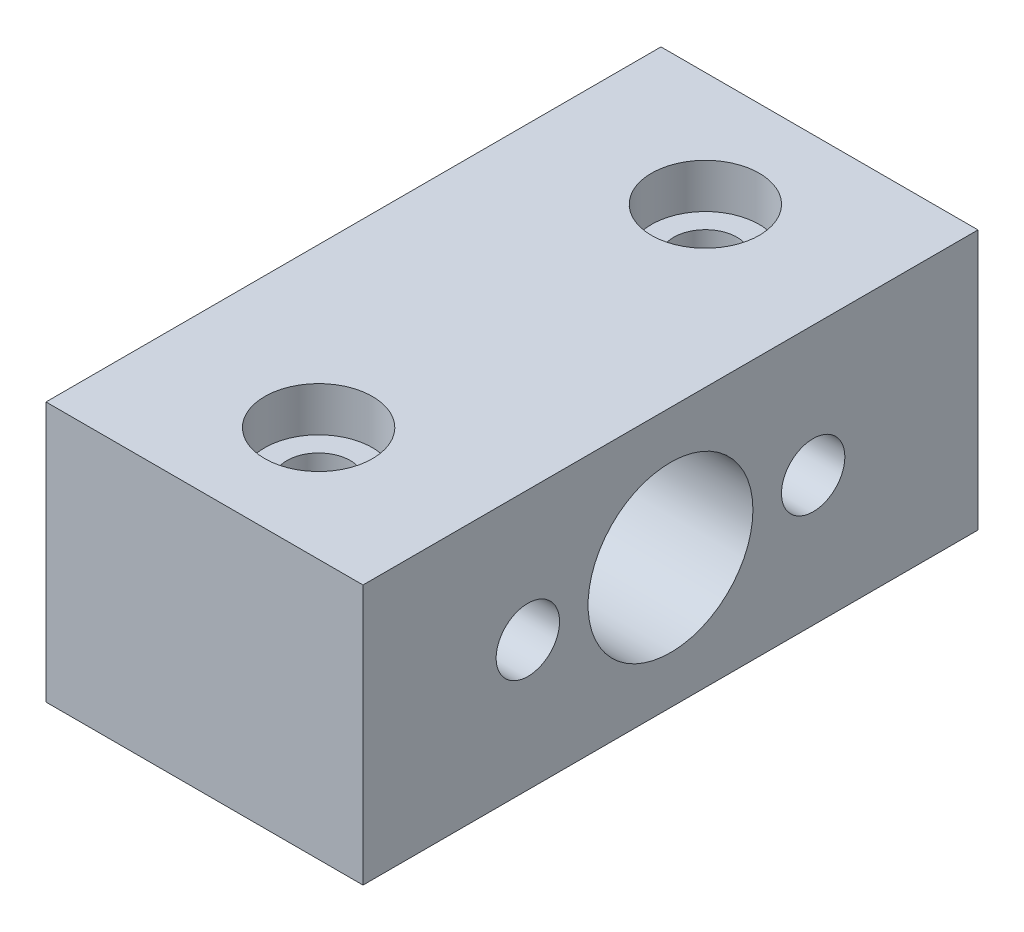
ISO-10303-21;
HEADER;
FILE_DESCRIPTION(('STEP AP214'),'2;1');
FILE_NAME('part.step','',(''),(''),'','','');
FILE_SCHEMA(('AUTOMOTIVE_DESIGN { 1 0 10303 214 1 1 1 1 }'));
ENDSEC;
DATA;
#1=APPLICATION_CONTEXT('core data for automotive mechanical design processes');
#2=APPLICATION_PROTOCOL_DEFINITION('international standard','automotive_design',2000,#1);
#3=PRODUCT_CONTEXT('',#1,'mechanical');
#4=PRODUCT('Part','Part','',(#3));
#5=PRODUCT_RELATED_PRODUCT_CATEGORY('part','',(#4));
#6=PRODUCT_DEFINITION_FORMATION('','',#4);
#7=PRODUCT_DEFINITION_CONTEXT('part definition',#1,'design');
#8=PRODUCT_DEFINITION('design','',#6,#7);
#9=PRODUCT_DEFINITION_SHAPE('','',#8);
#10=(LENGTH_UNIT() NAMED_UNIT(*) SI_UNIT(.MILLI.,.METRE.));
#11=(NAMED_UNIT(*) PLANE_ANGLE_UNIT() SI_UNIT($,.RADIAN.));
#12=(NAMED_UNIT(*) SI_UNIT($,.STERADIAN.) SOLID_ANGLE_UNIT());
#13=UNCERTAINTY_MEASURE_WITH_UNIT(LENGTH_MEASURE(1.E-05),#10,'distance_accuracy_value','');
#14=(GEOMETRIC_REPRESENTATION_CONTEXT(3) GLOBAL_UNCERTAINTY_ASSIGNED_CONTEXT((#13)) GLOBAL_UNIT_ASSIGNED_CONTEXT((#10,
#11,#12)) REPRESENTATION_CONTEXT('',''));
#15=CARTESIAN_POINT('',(0.,0.,0.));
#16=DIRECTION('',(0.,0.,1.));
#17=DIRECTION('',(1.,0.,0.));
#18=AXIS2_PLACEMENT_3D('',#15,#16,#17);
#19=CARTESIAN_POINT('',(-0.944881889763782,19.1712598425197,48.5));
#20=DIRECTION('',(1.,0.,0.));
#21=DIRECTION('',(0.,1.,0.));
#22=AXIS2_PLACEMENT_3D('',#19,#20,#21);
#23=PLANE('',#22);
#24=CARTESIAN_POINT('',(-0.944881889763782,8.92125984251969,24.25));
#25=DIRECTION('',(1.,0.,0.));
#26=DIRECTION('',(0.,1.,0.));
#27=AXIS2_PLACEMENT_3D('',#24,#25,#26);
#28=CIRCLE('',#27,6.5);
#29=CARTESIAN_POINT('',(-0.944881889763783,15.4212598425197,24.25));
#30=VERTEX_POINT('',#29);
#31=EDGE_CURVE('E132',#30,#30,#28,.F.);
#32=ORIENTED_EDGE('',*,*,#31,.F.);
#33=EDGE_LOOP('',(#32));
#34=FACE_BOUND('',#33,.T.);
#35=DIRECTION('',(0.,-1.,0.));
#36=VECTOR('',#35,1.);
#37=CARTESIAN_POINT('',(-0.944881889763782,19.1712598425197,0.));
#38=LINE('',#37,#36);
#39=CARTESIAN_POINT('',(-0.944881889763782,19.1712598425197,0.));
#40=VERTEX_POINT('',#39);
#41=CARTESIAN_POINT('',(-0.944881889763779,-1.32874015748032,0.));
#42=VERTEX_POINT('',#41);
#43=EDGE_CURVE('E95',#40,#42,#38,.T.);
#44=ORIENTED_EDGE('',*,*,#43,.T.);
#45=DIRECTION('',(0.,0.,-1.));
#46=VECTOR('',#45,1.);
#47=CARTESIAN_POINT('',(-0.944881889763779,-1.32874015748032,48.5));
#48=LINE('',#47,#46);
#49=CARTESIAN_POINT('',(-0.944881889763779,-1.32874015748032,48.5));
#50=VERTEX_POINT('',#49);
#51=EDGE_CURVE('E11',#50,#42,#48,.T.);
#52=ORIENTED_EDGE('',*,*,#51,.F.);
#53=DIRECTION('',(0.,-1.,0.));
#54=VECTOR('',#53,1.);
#55=CARTESIAN_POINT('',(-0.944881889763782,19.1712598425197,48.5));
#56=LINE('',#55,#54);
#57=CARTESIAN_POINT('',(-0.944881889763782,19.1712598425197,48.5));
#58=VERTEX_POINT('',#57);
#59=EDGE_CURVE('E83',#58,#50,#56,.T.);
#60=ORIENTED_EDGE('',*,*,#59,.F.);
#61=DIRECTION('',(0.,0.,-1.));
#62=VECTOR('',#61,1.);
#63=CARTESIAN_POINT('',(-0.944881889763782,19.1712598425197,48.5));
#64=LINE('',#63,#62);
#65=EDGE_CURVE('E91',#58,#40,#64,.T.);
#66=ORIENTED_EDGE('',*,*,#65,.T.);
#67=EDGE_LOOP('',(#44,#52,#60,#66));
#68=FACE_BOUND('',#67,.T.);
#69=ADVANCED_FACE('F32',(#34,#68),#23,.F.);
#70=CARTESIAN_POINT('',(-0.944881889763779,-1.32874015748032,48.5));
#71=DIRECTION('',(0.,1.,0.));
#72=DIRECTION('',(0.,0.,1.));
#73=AXIS2_PLACEMENT_3D('',#70,#71,#72);
#74=PLANE('',#73);
#75=CARTESIAN_POINT('',(11.5551181102362,-1.32874015748032,9.));
#76=DIRECTION('',(0.,1.,0.));
#77=DIRECTION('',(0.,0.,1.));
#78=AXIS2_PLACEMENT_3D('',#75,#76,#77);
#79=CIRCLE('',#78,2.5);
#80=CARTESIAN_POINT('',(11.5551181102362,-1.32874015748032,11.5));
#81=VERTEX_POINT('',#80);
#82=EDGE_CURVE('E126',#81,#81,#79,.F.);
#83=ORIENTED_EDGE('',*,*,#82,.F.);
#84=EDGE_LOOP('',(#83));
#85=FACE_BOUND('',#84,.T.);
#86=CARTESIAN_POINT('',(11.5551181102362,-1.32874015748032,39.5));
#87=DIRECTION('',(0.,1.,0.));
#88=DIRECTION('',(0.,0.,1.));
#89=AXIS2_PLACEMENT_3D('',#86,#87,#88);
#90=CIRCLE('',#89,2.5);
#91=CARTESIAN_POINT('',(11.5551181102362,-1.32874015748032,42.));
#92=VERTEX_POINT('',#91);
#93=EDGE_CURVE('E118',#92,#92,#90,.F.);
#94=ORIENTED_EDGE('',*,*,#93,.F.);
#95=EDGE_LOOP('',(#94));
#96=FACE_BOUND('',#95,.T.);
#97=DIRECTION('',(1.,0.,0.));
#98=VECTOR('',#97,1.);
#99=CARTESIAN_POINT('',(-0.944881889763779,-1.32874015748032,0.));
#100=LINE('',#99,#98);
#101=CARTESIAN_POINT('',(24.0551181102362,-1.32874015748032,0.));
#102=VERTEX_POINT('',#101);
#103=EDGE_CURVE('E87',#42,#102,#100,.T.);
#104=ORIENTED_EDGE('',*,*,#103,.T.);
#105=DIRECTION('',(0.,0.,-1.));
#106=VECTOR('',#105,1.);
#107=CARTESIAN_POINT('',(24.0551181102362,-1.32874015748032,48.5));
#108=LINE('',#107,#106);
#109=CARTESIAN_POINT('',(24.0551181102362,-1.32874015748032,48.5));
#110=VERTEX_POINT('',#109);
#111=EDGE_CURVE('E40',#110,#102,#108,.T.);
#112=ORIENTED_EDGE('',*,*,#111,.F.);
#113=DIRECTION('',(1.,0.,0.));
#114=VECTOR('',#113,1.);
#115=CARTESIAN_POINT('',(-0.944881889763779,-1.32874015748032,48.5));
#116=LINE('',#115,#114);
#117=EDGE_CURVE('E78',#50,#110,#116,.T.);
#118=ORIENTED_EDGE('',*,*,#117,.F.);
#119=ORIENTED_EDGE('',*,*,#51,.T.);
#120=EDGE_LOOP('',(#104,#112,#118,#119));
#121=FACE_BOUND('',#120,.T.);
#122=ADVANCED_FACE('F86',(#85,#96,#121),#74,.F.);
#123=CARTESIAN_POINT('',(24.0551181102362,19.1712598425197,48.5));
#124=DIRECTION('',(-1.,0.,0.));
#125=DIRECTION('',(0.,0.,1.));
#126=AXIS2_PLACEMENT_3D('',#123,#124,#125);
#127=PLANE('',#126);
#128=CARTESIAN_POINT('',(24.0551181102362,8.92125984251969,35.5));
#129=DIRECTION('',(1.,0.,0.));
#130=DIRECTION('',(0.,0.,-1.));
#131=AXIS2_PLACEMENT_3D('',#128,#129,#130);
#132=CIRCLE('',#131,2.5);
#133=CARTESIAN_POINT('',(24.0551181102362,8.92125984251969,33.));
#134=VERTEX_POINT('',#133);
#135=EDGE_CURVE('E145',#134,#134,#132,.T.);
#136=ORIENTED_EDGE('',*,*,#135,.F.);
#137=EDGE_LOOP('',(#136));
#138=FACE_BOUND('',#137,.T.);
#139=CARTESIAN_POINT('',(24.0551181102362,8.92125984251969,13.));
#140=DIRECTION('',(1.,0.,0.));
#141=DIRECTION('',(0.,0.,-1.));
#142=AXIS2_PLACEMENT_3D('',#139,#140,#141);
#143=CIRCLE('',#142,2.5);
#144=CARTESIAN_POINT('',(24.0551181102362,8.92125984251969,10.5));
#145=VERTEX_POINT('',#144);
#146=EDGE_CURVE('E139',#145,#145,#143,.T.);
#147=ORIENTED_EDGE('',*,*,#146,.F.);
#148=EDGE_LOOP('',(#147));
#149=FACE_BOUND('',#148,.T.);
#150=CARTESIAN_POINT('',(24.0551181102362,8.92125984251969,24.25));
#151=DIRECTION('',(1.,0.,0.));
#152=DIRECTION('',(0.,0.,-1.));
#153=AXIS2_PLACEMENT_3D('',#150,#151,#152);
#154=CIRCLE('',#153,6.5);
#155=CARTESIAN_POINT('',(24.0551181102362,8.92125984251969,17.75));
#156=VERTEX_POINT('',#155);
#157=EDGE_CURVE('E135',#156,#156,#154,.T.);
#158=ORIENTED_EDGE('',*,*,#157,.F.);
#159=EDGE_LOOP('',(#158));
#160=FACE_BOUND('',#159,.T.);
#161=DIRECTION('',(0.,1.,0.));
#162=VECTOR('',#161,1.);
#163=CARTESIAN_POINT('',(24.0551181102362,19.1712598425197,0.));
#164=LINE('',#163,#162);
#165=CARTESIAN_POINT('',(24.0551181102362,19.1712598425197,0.));
#166=VERTEX_POINT('',#165);
#167=EDGE_CURVE('E65',#102,#166,#164,.T.);
#168=ORIENTED_EDGE('',*,*,#167,.T.);
#169=DIRECTION('',(0.,0.,-1.));
#170=VECTOR('',#169,1.);
#171=CARTESIAN_POINT('',(24.0551181102362,19.1712598425197,48.5));
#172=LINE('',#171,#170);
#173=CARTESIAN_POINT('',(24.0551181102362,19.1712598425197,48.5));
#174=VERTEX_POINT('',#173);
#175=EDGE_CURVE('E88',#174,#166,#172,.T.);
#176=ORIENTED_EDGE('',*,*,#175,.F.);
#177=DIRECTION('',(0.,1.,0.));
#178=VECTOR('',#177,1.);
#179=CARTESIAN_POINT('',(24.0551181102362,19.1712598425197,48.5));
#180=LINE('',#179,#178);
#181=EDGE_CURVE('E81',#110,#174,#180,.T.);
#182=ORIENTED_EDGE('',*,*,#181,.F.);
#183=ORIENTED_EDGE('',*,*,#111,.T.);
#184=EDGE_LOOP('',(#168,#176,#182,#183));
#185=FACE_BOUND('',#184,.T.);
#186=ADVANCED_FACE('F89',(#138,#149,#160,#185),#127,.F.);
#187=CARTESIAN_POINT('',(-0.944881889763782,19.1712598425197,48.5));
#188=DIRECTION('',(0.,-1.,0.));
#189=DIRECTION('',(0.,0.,-1.));
#190=AXIS2_PLACEMENT_3D('',#187,#188,#189);
#191=PLANE('',#190);
#192=CARTESIAN_POINT('',(11.5551181102362,19.1712598425197,9.));
#193=DIRECTION('',(0.,1.,0.));
#194=DIRECTION('',(0.,0.,1.));
#195=AXIS2_PLACEMENT_3D('',#192,#193,#194);
#196=CIRCLE('',#195,4.25000000000001);
#197=CARTESIAN_POINT('',(11.5551181102362,19.1712598425197,13.25));
#198=VERTEX_POINT('',#197);
#199=EDGE_CURVE('E115',#198,#198,#196,.T.);
#200=ORIENTED_EDGE('',*,*,#199,.F.);
#201=EDGE_LOOP('',(#200));
#202=FACE_BOUND('',#201,.T.);
#203=CARTESIAN_POINT('',(11.5551181102362,19.1712598425197,39.5));
#204=DIRECTION('',(0.,1.,0.));
#205=DIRECTION('',(0.,0.,1.));
#206=AXIS2_PLACEMENT_3D('',#203,#204,#205);
#207=CIRCLE('',#206,4.25000000000001);
#208=CARTESIAN_POINT('',(11.5551181102362,19.1712598425197,43.75));
#209=VERTEX_POINT('',#208);
#210=EDGE_CURVE('E109',#209,#209,#207,.T.);
#211=ORIENTED_EDGE('',*,*,#210,.F.);
#212=EDGE_LOOP('',(#211));
#213=FACE_BOUND('',#212,.T.);
#214=DIRECTION('',(-1.,0.,0.));
#215=VECTOR('',#214,1.);
#216=CARTESIAN_POINT('',(-0.944881889763782,19.1712598425197,0.));
#217=LINE('',#216,#215);
#218=EDGE_CURVE('E71',#166,#40,#217,.T.);
#219=ORIENTED_EDGE('',*,*,#218,.T.);
#220=ORIENTED_EDGE('',*,*,#65,.F.);
#221=DIRECTION('',(-1.,0.,0.));
#222=VECTOR('',#221,1.);
#223=CARTESIAN_POINT('',(-0.944881889763782,19.1712598425197,48.5));
#224=LINE('',#223,#222);
#225=EDGE_CURVE('E48',#174,#58,#224,.T.);
#226=ORIENTED_EDGE('',*,*,#225,.F.);
#227=ORIENTED_EDGE('',*,*,#175,.T.);
#228=EDGE_LOOP('',(#219,#220,#226,#227));
#229=FACE_BOUND('',#228,.T.);
#230=ADVANCED_FACE('F103',(#202,#213,#229),#191,.F.);
#231=CARTESIAN_POINT('',(0.,0.,48.5));
#232=DIRECTION('',(0.,0.,1.));
#233=DIRECTION('',(1.,0.,0.));
#234=AXIS2_PLACEMENT_3D('',#231,#232,#233);
#235=PLANE('',#234);
#236=ORIENTED_EDGE('',*,*,#59,.T.);
#237=ORIENTED_EDGE('',*,*,#117,.T.);
#238=ORIENTED_EDGE('',*,*,#181,.T.);
#239=ORIENTED_EDGE('',*,*,#225,.T.);
#240=EDGE_LOOP('',(#236,#237,#238,#239));
#241=FACE_BOUND('',#240,.T.);
#242=ADVANCED_FACE('F79',(#241),#235,.T.);
#243=CARTESIAN_POINT('',(0.,0.,0.));
#244=DIRECTION('',(0.,0.,1.));
#245=DIRECTION('',(1.,0.,0.));
#246=AXIS2_PLACEMENT_3D('',#243,#244,#245);
#247=PLANE('',#246);
#248=ORIENTED_EDGE('',*,*,#43,.F.);
#249=ORIENTED_EDGE('',*,*,#218,.F.);
#250=ORIENTED_EDGE('',*,*,#167,.F.);
#251=ORIENTED_EDGE('',*,*,#103,.F.);
#252=EDGE_LOOP('',(#248,#249,#250,#251));
#253=FACE_BOUND('',#252,.T.);
#254=ADVANCED_FACE('F106',(#253),#247,.F.);
#255=CARTESIAN_POINT('',(11.5551181102362,15.6712598425197,39.5));
#256=DIRECTION('',(0.,1.,0.));
#257=DIRECTION('',(0.,0.,1.));
#258=AXIS2_PLACEMENT_3D('',#255,#256,#257);
#259=CYLINDRICAL_SURFACE('',#258,4.25000000000001);
#260=CARTESIAN_POINT('',(11.5551181102362,15.6712598425197,39.5));
#261=DIRECTION('',(0.,1.,0.));
#262=DIRECTION('',(0.,0.,1.));
#263=AXIS2_PLACEMENT_3D('',#260,#261,#262);
#264=CIRCLE('',#263,4.25000000000001);
#265=CARTESIAN_POINT('',(11.5551181102362,15.6712598425197,43.75));
#266=VERTEX_POINT('',#265);
#267=EDGE_CURVE('E98',#266,#266,#264,.T.);
#268=ORIENTED_EDGE('',*,*,#267,.F.);
#269=EDGE_LOOP('',(#268));
#270=FACE_BOUND('',#269,.T.);
#271=ORIENTED_EDGE('',*,*,#210,.T.);
#272=EDGE_LOOP('',(#271));
#273=FACE_BOUND('',#272,.T.);
#274=ADVANCED_FACE('F199',(#270,#273),#259,.F.);
#275=CARTESIAN_POINT('',(11.5551181102362,15.6712598425197,39.5));
#276=DIRECTION('',(0.,1.,0.));
#277=DIRECTION('',(0.,0.,1.));
#278=AXIS2_PLACEMENT_3D('',#275,#276,#277);
#279=PLANE('',#278);
#280=CARTESIAN_POINT('',(11.5551181102362,15.6712598425197,39.5));
#281=DIRECTION('',(0.,1.,0.));
#282=DIRECTION('',(0.,0.,1.));
#283=AXIS2_PLACEMENT_3D('',#280,#281,#282);
#284=CIRCLE('',#283,2.5);
#285=CARTESIAN_POINT('',(11.5551181102362,15.6712598425197,42.));
#286=VERTEX_POINT('',#285);
#287=EDGE_CURVE('E123',#286,#286,#284,.T.);
#288=ORIENTED_EDGE('',*,*,#287,.F.);
#289=EDGE_LOOP('',(#288));
#290=FACE_BOUND('',#289,.T.);
#291=ORIENTED_EDGE('',*,*,#267,.T.);
#292=EDGE_LOOP('',(#291));
#293=FACE_BOUND('',#292,.T.);
#294=ADVANCED_FACE('F204',(#290,#293),#279,.T.);
#295=CARTESIAN_POINT('',(11.5551181102362,15.6712598425197,9.));
#296=DIRECTION('',(0.,1.,0.));
#297=DIRECTION('',(0.,0.,1.));
#298=AXIS2_PLACEMENT_3D('',#295,#296,#297);
#299=CYLINDRICAL_SURFACE('',#298,4.25000000000001);
#300=CARTESIAN_POINT('',(11.5551181102362,15.6712598425197,9.));
#301=DIRECTION('',(0.,1.,0.));
#302=DIRECTION('',(0.,0.,1.));
#303=AXIS2_PLACEMENT_3D('',#300,#301,#302);
#304=CIRCLE('',#303,4.25000000000001);
#305=CARTESIAN_POINT('',(11.5551181102362,15.6712598425197,13.25));
#306=VERTEX_POINT('',#305);
#307=EDGE_CURVE('E112',#306,#306,#304,.T.);
#308=ORIENTED_EDGE('',*,*,#307,.F.);
#309=EDGE_LOOP('',(#308));
#310=FACE_BOUND('',#309,.T.);
#311=ORIENTED_EDGE('',*,*,#199,.T.);
#312=EDGE_LOOP('',(#311));
#313=FACE_BOUND('',#312,.T.);
#314=ADVANCED_FACE('F208',(#310,#313),#299,.F.);
#315=CARTESIAN_POINT('',(11.5551181102362,15.6712598425197,9.));
#316=DIRECTION('',(0.,1.,0.));
#317=DIRECTION('',(0.,0.,1.));
#318=AXIS2_PLACEMENT_3D('',#315,#316,#317);
#319=PLANE('',#318);
#320=CARTESIAN_POINT('',(11.5551181102362,15.6712598425197,9.));
#321=DIRECTION('',(0.,1.,0.));
#322=DIRECTION('',(0.,0.,1.));
#323=AXIS2_PLACEMENT_3D('',#320,#321,#322);
#324=CIRCLE('',#323,2.5);
#325=CARTESIAN_POINT('',(11.5551181102362,15.6712598425197,11.5));
#326=VERTEX_POINT('',#325);
#327=EDGE_CURVE('E129',#326,#326,#324,.T.);
#328=ORIENTED_EDGE('',*,*,#327,.F.);
#329=EDGE_LOOP('',(#328));
#330=FACE_BOUND('',#329,.T.);
#331=ORIENTED_EDGE('',*,*,#307,.T.);
#332=EDGE_LOOP('',(#331));
#333=FACE_BOUND('',#332,.T.);
#334=ADVANCED_FACE('F212',(#330,#333),#319,.T.);
#335=CARTESIAN_POINT('',(11.5551181102362,-8.39980796934579,39.5));
#336=DIRECTION('',(0.,1.,0.));
#337=DIRECTION('',(0.,0.,1.));
#338=AXIS2_PLACEMENT_3D('',#335,#336,#337);
#339=CYLINDRICAL_SURFACE('',#338,2.5);
#340=ORIENTED_EDGE('',*,*,#93,.T.);
#341=EDGE_LOOP('',(#340));
#342=FACE_BOUND('',#341,.T.);
#343=ORIENTED_EDGE('',*,*,#287,.T.);
#344=EDGE_LOOP('',(#343));
#345=FACE_BOUND('',#344,.T.);
#346=ADVANCED_FACE('F179',(#342,#345),#339,.F.);
#347=CARTESIAN_POINT('',(11.5551181102362,-8.39980796934579,9.));
#348=DIRECTION('',(0.,1.,0.));
#349=DIRECTION('',(0.,0.,1.));
#350=AXIS2_PLACEMENT_3D('',#347,#348,#349);
#351=CYLINDRICAL_SURFACE('',#350,2.5);
#352=ORIENTED_EDGE('',*,*,#82,.T.);
#353=EDGE_LOOP('',(#352));
#354=FACE_BOUND('',#353,.T.);
#355=ORIENTED_EDGE('',*,*,#327,.T.);
#356=EDGE_LOOP('',(#355));
#357=FACE_BOUND('',#356,.T.);
#358=ADVANCED_FACE('F170',(#354,#357),#351,.F.);
#359=CARTESIAN_POINT('',(-19.329658200614,8.92125984251969,24.25));
#360=DIRECTION('',(1.,0.,0.));
#361=DIRECTION('',(0.,0.,-1.));
#362=AXIS2_PLACEMENT_3D('',#359,#360,#361);
#363=CYLINDRICAL_SURFACE('',#362,6.5);
#364=ORIENTED_EDGE('',*,*,#31,.T.);
#365=EDGE_LOOP('',(#364));
#366=FACE_BOUND('',#365,.T.);
#367=ORIENTED_EDGE('',*,*,#157,.T.);
#368=EDGE_LOOP('',(#367));
#369=FACE_BOUND('',#368,.T.);
#370=ADVANCED_FACE('F167',(#366,#369),#363,.F.);
#371=CARTESIAN_POINT('',(14.0551181102362,8.92125984251969,13.));
#372=DIRECTION('',(1.,0.,0.));
#373=DIRECTION('',(0.,0.,-1.));
#374=AXIS2_PLACEMENT_3D('',#371,#372,#373);
#375=CYLINDRICAL_SURFACE('',#374,2.5);
#376=CARTESIAN_POINT('',(14.0551181102362,8.92125984251969,13.));
#377=DIRECTION('',(1.,0.,0.));
#378=DIRECTION('',(0.,0.,-1.));
#379=AXIS2_PLACEMENT_3D('',#376,#377,#378);
#380=CIRCLE('',#379,2.5);
#381=CARTESIAN_POINT('',(14.0551181102362,8.92125984251969,10.5));
#382=VERTEX_POINT('',#381);
#383=EDGE_CURVE('E138',#382,#382,#380,.T.);
#384=ORIENTED_EDGE('',*,*,#383,.F.);
#385=EDGE_LOOP('',(#384));
#386=FACE_BOUND('',#385,.T.);
#387=ORIENTED_EDGE('',*,*,#146,.T.);
#388=EDGE_LOOP('',(#387));
#389=FACE_BOUND('',#388,.T.);
#390=ADVANCED_FACE('F169',(#386,#389),#375,.F.);
#391=CARTESIAN_POINT('',(14.0551181102362,8.92125984251969,13.));
#392=DIRECTION('',(1.,0.,0.));
#393=DIRECTION('',(0.,0.,-1.));
#394=AXIS2_PLACEMENT_3D('',#391,#392,#393);
#395=PLANE('',#394);
#396=ORIENTED_EDGE('',*,*,#383,.T.);
#397=EDGE_LOOP('',(#396));
#398=FACE_BOUND('',#397,.T.);
#399=ADVANCED_FACE('F156',(#398),#395,.T.);
#400=CARTESIAN_POINT('',(14.0551181102362,8.92125984251969,35.5));
#401=DIRECTION('',(1.,0.,0.));
#402=DIRECTION('',(0.,0.,-1.));
#403=AXIS2_PLACEMENT_3D('',#400,#401,#402);
#404=CYLINDRICAL_SURFACE('',#403,2.5);
#405=CARTESIAN_POINT('',(14.0551181102362,8.92125984251969,35.5));
#406=DIRECTION('',(1.,0.,0.));
#407=DIRECTION('',(0.,0.,-1.));
#408=AXIS2_PLACEMENT_3D('',#405,#406,#407);
#409=CIRCLE('',#408,2.5);
#410=CARTESIAN_POINT('',(14.0551181102362,8.92125984251969,33.));
#411=VERTEX_POINT('',#410);
#412=EDGE_CURVE('E142',#411,#411,#409,.T.);
#413=ORIENTED_EDGE('',*,*,#412,.F.);
#414=EDGE_LOOP('',(#413));
#415=FACE_BOUND('',#414,.T.);
#416=ORIENTED_EDGE('',*,*,#135,.T.);
#417=EDGE_LOOP('',(#416));
#418=FACE_BOUND('',#417,.T.);
#419=ADVANCED_FACE('F153',(#415,#418),#404,.F.);
#420=CARTESIAN_POINT('',(14.0551181102362,8.92125984251969,35.5));
#421=DIRECTION('',(1.,0.,0.));
#422=DIRECTION('',(0.,0.,-1.));
#423=AXIS2_PLACEMENT_3D('',#420,#421,#422);
#424=PLANE('',#423);
#425=ORIENTED_EDGE('',*,*,#412,.T.);
#426=EDGE_LOOP('',(#425));
#427=FACE_BOUND('',#426,.T.);
#428=ADVANCED_FACE('F151',(#427),#424,.T.);
#429=CLOSED_SHELL('',(#69,#122,#186,#230,#242,#254,#274,#294,#314,#334,#346,#358,#370,#390,#399,
#419,#428));
#430=MANIFOLD_SOLID_BREP('B2',#429);
#431=ADVANCED_BREP_SHAPE_REPRESENTATION('',(#18,#430),#14);
#432=SHAPE_DEFINITION_REPRESENTATION(#9,#431);
ENDSEC;
END-ISO-10303-21;
